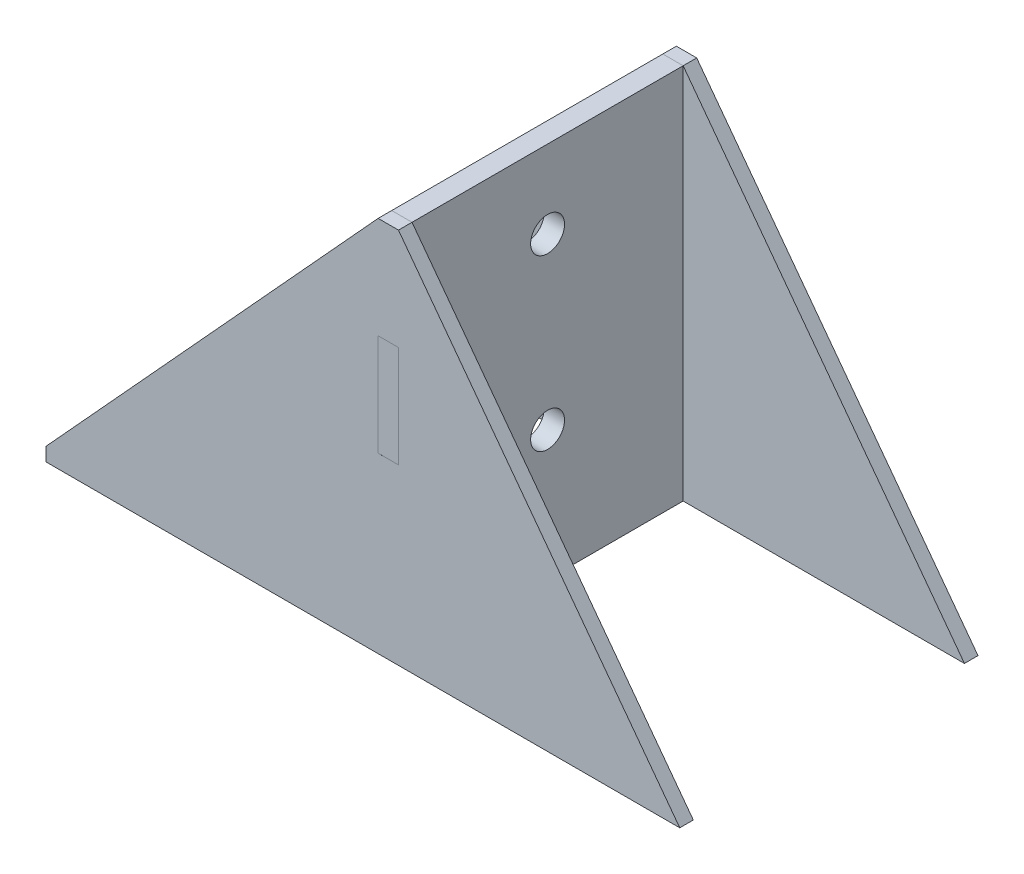
ISO-10303-21;
HEADER;
FILE_DESCRIPTION(('STEP AP214'),'2;1');
FILE_NAME('part.step','',(''),(''),'','','');
FILE_SCHEMA(('AUTOMOTIVE_DESIGN { 1 0 10303 214 1 1 1 1 }'));
ENDSEC;
DATA;
#1=APPLICATION_CONTEXT('core data for automotive mechanical design processes');
#2=APPLICATION_PROTOCOL_DEFINITION('international standard','automotive_design',2000,#1);
#3=PRODUCT_CONTEXT('',#1,'mechanical');
#4=PRODUCT('Part','Part','',(#3));
#5=PRODUCT_RELATED_PRODUCT_CATEGORY('part','',(#4));
#6=PRODUCT_DEFINITION_FORMATION('','',#4);
#7=PRODUCT_DEFINITION_CONTEXT('part definition',#1,'design');
#8=PRODUCT_DEFINITION('design','',#6,#7);
#9=PRODUCT_DEFINITION_SHAPE('','',#8);
#10=(LENGTH_UNIT() NAMED_UNIT(*) SI_UNIT(.MILLI.,.METRE.));
#11=(NAMED_UNIT(*) PLANE_ANGLE_UNIT() SI_UNIT($,.RADIAN.));
#12=(NAMED_UNIT(*) SI_UNIT($,.STERADIAN.) SOLID_ANGLE_UNIT());
#13=UNCERTAINTY_MEASURE_WITH_UNIT(LENGTH_MEASURE(1.E-05),#10,'distance_accuracy_value','');
#14=(GEOMETRIC_REPRESENTATION_CONTEXT(3) GLOBAL_UNCERTAINTY_ASSIGNED_CONTEXT((#13)) GLOBAL_UNIT_ASSIGNED_CONTEXT((#10,
#11,#12)) REPRESENTATION_CONTEXT('',''));
#15=CARTESIAN_POINT('',(0.,0.,0.));
#16=DIRECTION('',(0.,0.,1.));
#17=DIRECTION('',(1.,0.,0.));
#18=AXIS2_PLACEMENT_3D('',#15,#16,#17);
#19=CARTESIAN_POINT('',(-65.8153912675226,0.,157.10520039133));
#20=DIRECTION('',(0.,0.,-1.));
#21=DIRECTION('',(-1.,0.,0.));
#22=AXIS2_PLACEMENT_3D('',#19,#20,#21);
#23=PLANE('',#22);
#24=DIRECTION('',(-0.5980153399495,0.801484655614245,0.));
#25=VECTOR('',#24,1.);
#26=CARTESIAN_POINT('',(285.648958862232,112.506287625418,157.10520039133));
#27=LINE('',#26,#25);
#28=CARTESIAN_POINT('',(368.648958862232,1.26628762541804,157.10520039133));
#29=VERTEX_POINT('',#28);
#30=CARTESIAN_POINT('',(285.648958862232,112.506287625418,157.10520039133));
#31=VERTEX_POINT('',#30);
#32=EDGE_CURVE('E150',#29,#31,#27,.T.);
#33=ORIENTED_EDGE('',*,*,#32,.T.);
#34=DIRECTION('',(-1.,0.,0.));
#35=VECTOR('',#34,1.);
#36=CARTESIAN_POINT('',(285.648958862232,112.506287625418,157.10520039133));
#37=LINE('',#36,#35);
#38=CARTESIAN_POINT('',(279.648958862232,112.506287625418,157.10520039133));
#39=VERTEX_POINT('',#38);
#40=EDGE_CURVE('E153',#31,#39,#37,.T.);
#41=ORIENTED_EDGE('',*,*,#40,.T.);
#42=DIRECTION('',(-0.674589209040015,-0.738193334463788,0.));
#43=VECTOR('',#42,1.);
#44=CARTESIAN_POINT('',(279.648958862232,112.506287625418,157.10520039133));
#45=LINE('',#44,#43);
#46=CARTESIAN_POINT('',(181.648958862232,5.26628762541804,157.10520039133));
#47=VERTEX_POINT('',#46);
#48=EDGE_CURVE('E156',#39,#47,#45,.T.);
#49=ORIENTED_EDGE('',*,*,#48,.T.);
#50=DIRECTION('',(0.,-1.,0.));
#51=VECTOR('',#50,1.);
#52=CARTESIAN_POINT('',(181.648958862232,5.26628762541804,157.10520039133));
#53=LINE('',#52,#51);
#54=CARTESIAN_POINT('',(181.648958862232,1.26628762541804,157.10520039133));
#55=VERTEX_POINT('',#54);
#56=EDGE_CURVE('E158',#47,#55,#53,.T.);
#57=ORIENTED_EDGE('',*,*,#56,.T.);
#58=DIRECTION('',(1.,0.,0.));
#59=VECTOR('',#58,1.);
#60=CARTESIAN_POINT('',(181.648958862232,1.26628762541804,157.10520039133));
#61=LINE('',#60,#59);
#62=EDGE_CURVE('E160',#55,#29,#61,.T.);
#63=ORIENTED_EDGE('',*,*,#62,.T.);
#64=EDGE_LOOP('',(#33,#41,#49,#57,#63));
#65=FACE_BOUND('',#64,.T.);
#66=DIRECTION('',(1.,0.,0.));
#67=VECTOR('',#66,1.);
#68=CARTESIAN_POINT('',(285.648958862232,52.506287625418,157.10520039133));
#69=LINE('',#68,#67);
#70=CARTESIAN_POINT('',(279.648958862232,52.506287625418,157.10520039133));
#71=VERTEX_POINT('',#70);
#72=CARTESIAN_POINT('',(285.648958862232,52.506287625418,157.10520039133));
#73=VERTEX_POINT('',#72);
#74=EDGE_CURVE('E114',#71,#73,#69,.T.);
#75=ORIENTED_EDGE('',*,*,#74,.F.);
#76=DIRECTION('',(0.,-1.,0.));
#77=VECTOR('',#76,1.);
#78=CARTESIAN_POINT('',(279.648958862232,82.5062876254181,157.10520039133));
#79=LINE('',#78,#77);
#80=CARTESIAN_POINT('',(279.648958862232,82.5062876254181,157.10520039133));
#81=VERTEX_POINT('',#80);
#82=EDGE_CURVE('E136',#81,#71,#79,.T.);
#83=ORIENTED_EDGE('',*,*,#82,.F.);
#84=DIRECTION('',(-1.,0.,0.));
#85=VECTOR('',#84,1.);
#86=CARTESIAN_POINT('',(285.648958862232,82.5062876254181,157.10520039133));
#87=LINE('',#86,#85);
#88=CARTESIAN_POINT('',(285.648958862232,82.5062876254181,157.10520039133));
#89=VERTEX_POINT('',#88);
#90=EDGE_CURVE('E134',#89,#81,#87,.T.);
#91=ORIENTED_EDGE('',*,*,#90,.F.);
#92=DIRECTION('',(0.,1.,0.));
#93=VECTOR('',#92,1.);
#94=CARTESIAN_POINT('',(285.648958862232,52.506287625418,157.10520039133));
#95=LINE('',#94,#93);
#96=EDGE_CURVE('E122',#73,#89,#95,.T.);
#97=ORIENTED_EDGE('',*,*,#96,.F.);
#98=EDGE_LOOP('',(#75,#83,#91,#97));
#99=FACE_BOUND('',#98,.T.);
#100=ADVANCED_FACE('F43',(#65,#99),#23,.F.);
#101=CARTESIAN_POINT('',(-65.8153912675226,0.,153.10520039133));
#102=DIRECTION('',(0.,0.,-1.));
#103=DIRECTION('',(-1.,0.,0.));
#104=AXIS2_PLACEMENT_3D('',#101,#102,#103);
#105=PLANE('',#104);
#106=DIRECTION('',(-0.5980153399495,0.801484655614245,0.));
#107=VECTOR('',#106,1.);
#108=CARTESIAN_POINT('',(285.648958862232,112.506287625418,153.10520039133));
#109=LINE('',#108,#107);
#110=CARTESIAN_POINT('',(368.648958862232,1.26628762541804,153.10520039133));
#111=VERTEX_POINT('',#110);
#112=CARTESIAN_POINT('',(285.648958862232,112.506287625418,153.10520039133));
#113=VERTEX_POINT('',#112);
#114=EDGE_CURVE('E130',#111,#113,#109,.T.);
#115=ORIENTED_EDGE('',*,*,#114,.F.);
#116=DIRECTION('',(1.,0.,0.));
#117=VECTOR('',#116,1.);
#118=CARTESIAN_POINT('',(181.648958862232,1.26628762541804,153.10520039133));
#119=LINE('',#118,#117);
#120=CARTESIAN_POINT('',(181.648958862232,1.26628762541804,153.10520039133));
#121=VERTEX_POINT('',#120);
#122=EDGE_CURVE('E154',#121,#111,#119,.T.);
#123=ORIENTED_EDGE('',*,*,#122,.F.);
#124=DIRECTION('',(0.,-1.,0.));
#125=VECTOR('',#124,1.);
#126=CARTESIAN_POINT('',(181.648958862232,5.26628762541804,153.10520039133));
#127=LINE('',#126,#125);
#128=CARTESIAN_POINT('',(181.648958862232,5.26628762541804,153.10520039133));
#129=VERTEX_POINT('',#128);
#130=EDGE_CURVE('E169',#129,#121,#127,.T.);
#131=ORIENTED_EDGE('',*,*,#130,.F.);
#132=DIRECTION('',(-0.674589209040015,-0.738193334463788,0.));
#133=VECTOR('',#132,1.);
#134=CARTESIAN_POINT('',(279.648958862232,112.506287625418,153.10520039133));
#135=LINE('',#134,#133);
#136=CARTESIAN_POINT('',(279.648958862232,112.506287625418,153.10520039133));
#137=VERTEX_POINT('',#136);
#138=EDGE_CURVE('E167',#137,#129,#135,.T.);
#139=ORIENTED_EDGE('',*,*,#138,.F.);
#140=DIRECTION('',(-1.,0.,0.));
#141=VECTOR('',#140,1.);
#142=CARTESIAN_POINT('',(285.648958862232,112.506287625418,153.10520039133));
#143=LINE('',#142,#141);
#144=EDGE_CURVE('E165',#113,#137,#143,.T.);
#145=ORIENTED_EDGE('',*,*,#144,.F.);
#146=EDGE_LOOP('',(#115,#123,#131,#139,#145));
#147=FACE_BOUND('',#146,.T.);
#148=DIRECTION('',(0.,-1.,0.));
#149=VECTOR('',#148,1.);
#150=CARTESIAN_POINT('',(279.648958862232,82.5062876254181,153.10520039133));
#151=LINE('',#150,#149);
#152=CARTESIAN_POINT('',(279.648958862232,82.5062876254181,153.10520039133));
#153=VERTEX_POINT('',#152);
#154=CARTESIAN_POINT('',(279.648958862232,52.506287625418,153.10520039133));
#155=VERTEX_POINT('',#154);
#156=EDGE_CURVE('E123',#153,#155,#151,.T.);
#157=ORIENTED_EDGE('',*,*,#156,.T.);
#158=DIRECTION('',(1.,0.,0.));
#159=VECTOR('',#158,1.);
#160=CARTESIAN_POINT('',(285.648958862232,52.506287625418,153.10520039133));
#161=LINE('',#160,#159);
#162=CARTESIAN_POINT('',(285.648958862232,52.506287625418,153.10520039133));
#163=VERTEX_POINT('',#162);
#164=EDGE_CURVE('E66',#155,#163,#161,.T.);
#165=ORIENTED_EDGE('',*,*,#164,.T.);
#166=DIRECTION('',(0.,1.,0.));
#167=VECTOR('',#166,1.);
#168=CARTESIAN_POINT('',(285.648958862232,52.506287625418,153.10520039133));
#169=LINE('',#168,#167);
#170=CARTESIAN_POINT('',(285.648958862232,82.5062876254181,153.10520039133));
#171=VERTEX_POINT('',#170);
#172=EDGE_CURVE('E129',#163,#171,#169,.T.);
#173=ORIENTED_EDGE('',*,*,#172,.T.);
#174=DIRECTION('',(-1.,0.,0.));
#175=VECTOR('',#174,1.);
#176=CARTESIAN_POINT('',(285.648958862232,82.5062876254181,153.10520039133));
#177=LINE('',#176,#175);
#178=EDGE_CURVE('E142',#171,#153,#177,.T.);
#179=ORIENTED_EDGE('',*,*,#178,.T.);
#180=EDGE_LOOP('',(#157,#165,#173,#179));
#181=FACE_BOUND('',#180,.T.);
#182=ADVANCED_FACE('F190',(#147,#181),#105,.T.);
#183=CARTESIAN_POINT('',(285.648958862232,112.506287625418,157.10520039133));
#184=DIRECTION('',(-0.801484655614245,-0.5980153399495,0.));
#185=DIRECTION('',(0.5980153399495,-0.801484655614245,0.));
#186=AXIS2_PLACEMENT_3D('',#183,#184,#185);
#187=PLANE('',#186);
#188=ORIENTED_EDGE('',*,*,#114,.T.);
#189=DIRECTION('',(0.,0.,-1.));
#190=VECTOR('',#189,1.);
#191=CARTESIAN_POINT('',(285.648958862232,112.506287625418,157.10520039133));
#192=LINE('',#191,#190);
#193=EDGE_CURVE('E12',#31,#113,#192,.T.);
#194=ORIENTED_EDGE('',*,*,#193,.F.);
#195=ORIENTED_EDGE('',*,*,#32,.F.);
#196=DIRECTION('',(0.,0.,-1.));
#197=VECTOR('',#196,1.);
#198=CARTESIAN_POINT('',(368.648958862232,1.26628762541804,157.10520039133));
#199=LINE('',#198,#197);
#200=EDGE_CURVE('E162',#29,#111,#199,.T.);
#201=ORIENTED_EDGE('',*,*,#200,.T.);
#202=EDGE_LOOP('',(#188,#194,#195,#201));
#203=FACE_BOUND('',#202,.T.);
#204=ADVANCED_FACE('F45',(#203),#187,.F.);
#205=CARTESIAN_POINT('',(285.648958862232,112.506287625418,157.10520039133));
#206=DIRECTION('',(0.,-1.,0.));
#207=DIRECTION('',(0.,0.,-1.));
#208=AXIS2_PLACEMENT_3D('',#205,#206,#207);
#209=PLANE('',#208);
#210=ORIENTED_EDGE('',*,*,#144,.T.);
#211=DIRECTION('',(0.,0.,-1.));
#212=VECTOR('',#211,1.);
#213=CARTESIAN_POINT('',(279.648958862232,112.506287625418,157.10520039133));
#214=LINE('',#213,#212);
#215=EDGE_CURVE('E51',#39,#137,#214,.T.);
#216=ORIENTED_EDGE('',*,*,#215,.F.);
#217=ORIENTED_EDGE('',*,*,#40,.F.);
#218=ORIENTED_EDGE('',*,*,#193,.T.);
#219=EDGE_LOOP('',(#210,#216,#217,#218));
#220=FACE_BOUND('',#219,.T.);
#221=ADVANCED_FACE('F204',(#220),#209,.F.);
#222=CARTESIAN_POINT('',(279.648958862232,112.506287625418,157.10520039133));
#223=DIRECTION('',(0.738193334463788,-0.674589209040015,0.));
#224=DIRECTION('',(0.674589209040015,0.738193334463788,0.));
#225=AXIS2_PLACEMENT_3D('',#222,#223,#224);
#226=PLANE('',#225);
#227=ORIENTED_EDGE('',*,*,#138,.T.);
#228=DIRECTION('',(0.,0.,-1.));
#229=VECTOR('',#228,1.);
#230=CARTESIAN_POINT('',(181.648958862232,5.26628762541804,157.10520039133));
#231=LINE('',#230,#229);
#232=EDGE_CURVE('E177',#47,#129,#231,.T.);
#233=ORIENTED_EDGE('',*,*,#232,.F.);
#234=ORIENTED_EDGE('',*,*,#48,.F.);
#235=ORIENTED_EDGE('',*,*,#215,.T.);
#236=EDGE_LOOP('',(#227,#233,#234,#235));
#237=FACE_BOUND('',#236,.T.);
#238=ADVANCED_FACE('F184',(#237),#226,.F.);
#239=CARTESIAN_POINT('',(181.648958862232,5.26628762541804,157.10520039133));
#240=DIRECTION('',(1.,0.,0.));
#241=DIRECTION('',(0.,1.,0.));
#242=AXIS2_PLACEMENT_3D('',#239,#240,#241);
#243=PLANE('',#242);
#244=ORIENTED_EDGE('',*,*,#130,.T.);
#245=DIRECTION('',(0.,0.,-1.));
#246=VECTOR('',#245,1.);
#247=CARTESIAN_POINT('',(181.648958862232,1.26628762541804,157.10520039133));
#248=LINE('',#247,#246);
#249=EDGE_CURVE('E174',#55,#121,#248,.T.);
#250=ORIENTED_EDGE('',*,*,#249,.F.);
#251=ORIENTED_EDGE('',*,*,#56,.F.);
#252=ORIENTED_EDGE('',*,*,#232,.T.);
#253=EDGE_LOOP('',(#244,#250,#251,#252));
#254=FACE_BOUND('',#253,.T.);
#255=ADVANCED_FACE('F195',(#254),#243,.F.);
#256=CARTESIAN_POINT('',(181.648958862232,1.26628762541804,157.10520039133));
#257=DIRECTION('',(0.,1.,0.));
#258=DIRECTION('',(-1.,0.,0.));
#259=AXIS2_PLACEMENT_3D('',#256,#257,#258);
#260=PLANE('',#259);
#261=ORIENTED_EDGE('',*,*,#122,.T.);
#262=ORIENTED_EDGE('',*,*,#200,.F.);
#263=ORIENTED_EDGE('',*,*,#62,.F.);
#264=ORIENTED_EDGE('',*,*,#249,.T.);
#265=EDGE_LOOP('',(#261,#262,#263,#264));
#266=FACE_BOUND('',#265,.T.);
#267=ADVANCED_FACE('F199',(#266),#260,.F.);
#268=CARTESIAN_POINT('',(285.648958862232,52.506287625418,157.10520039133));
#269=DIRECTION('',(0.,1.,0.));
#270=DIRECTION('',(0.,0.,1.));
#271=AXIS2_PLACEMENT_3D('',#268,#269,#270);
#272=PLANE('',#271);
#273=ORIENTED_EDGE('',*,*,#164,.F.);
#274=DIRECTION('',(0.,0.,-1.));
#275=VECTOR('',#274,1.);
#276=CARTESIAN_POINT('',(279.648958862232,52.506287625418,157.10520039133));
#277=LINE('',#276,#275);
#278=EDGE_CURVE('E118',#71,#155,#277,.T.);
#279=ORIENTED_EDGE('',*,*,#278,.F.);
#280=ORIENTED_EDGE('',*,*,#74,.T.);
#281=DIRECTION('',(0.,0.,-1.));
#282=VECTOR('',#281,1.);
#283=CARTESIAN_POINT('',(285.648958862232,52.506287625418,157.10520039133));
#284=LINE('',#283,#282);
#285=EDGE_CURVE('E117',#73,#163,#284,.T.);
#286=ORIENTED_EDGE('',*,*,#285,.T.);
#287=EDGE_LOOP('',(#273,#279,#280,#286));
#288=FACE_BOUND('',#287,.T.);
#289=ADVANCED_FACE('F116',(#288),#272,.T.);
#290=CARTESIAN_POINT('',(285.648958862232,52.506287625418,157.10520039133));
#291=DIRECTION('',(-1.,0.,0.));
#292=DIRECTION('',(0.,0.,1.));
#293=AXIS2_PLACEMENT_3D('',#290,#291,#292);
#294=PLANE('',#293);
#295=ORIENTED_EDGE('',*,*,#172,.F.);
#296=ORIENTED_EDGE('',*,*,#285,.F.);
#297=ORIENTED_EDGE('',*,*,#96,.T.);
#298=DIRECTION('',(0.,0.,-1.));
#299=VECTOR('',#298,1.);
#300=CARTESIAN_POINT('',(285.648958862232,82.5062876254181,157.10520039133));
#301=LINE('',#300,#299);
#302=EDGE_CURVE('E131',#89,#171,#301,.T.);
#303=ORIENTED_EDGE('',*,*,#302,.T.);
#304=EDGE_LOOP('',(#295,#296,#297,#303));
#305=FACE_BOUND('',#304,.T.);
#306=ADVANCED_FACE('F126',(#305),#294,.T.);
#307=CARTESIAN_POINT('',(285.648958862232,82.5062876254181,157.10520039133));
#308=DIRECTION('',(0.,-1.,0.));
#309=DIRECTION('',(0.,0.,-1.));
#310=AXIS2_PLACEMENT_3D('',#307,#308,#309);
#311=PLANE('',#310);
#312=ORIENTED_EDGE('',*,*,#178,.F.);
#313=ORIENTED_EDGE('',*,*,#302,.F.);
#314=ORIENTED_EDGE('',*,*,#90,.T.);
#315=DIRECTION('',(0.,0.,-1.));
#316=VECTOR('',#315,1.);
#317=CARTESIAN_POINT('',(279.648958862232,82.5062876254181,157.10520039133));
#318=LINE('',#317,#316);
#319=EDGE_CURVE('E58',#81,#153,#318,.T.);
#320=ORIENTED_EDGE('',*,*,#319,.T.);
#321=EDGE_LOOP('',(#312,#313,#314,#320));
#322=FACE_BOUND('',#321,.T.);
#323=ADVANCED_FACE('F247',(#322),#311,.T.);
#324=CARTESIAN_POINT('',(279.648958862232,82.5062876254181,157.10520039133));
#325=DIRECTION('',(1.,0.,0.));
#326=DIRECTION('',(0.,0.,-1.));
#327=AXIS2_PLACEMENT_3D('',#324,#325,#326);
#328=PLANE('',#327);
#329=ORIENTED_EDGE('',*,*,#156,.F.);
#330=ORIENTED_EDGE('',*,*,#319,.F.);
#331=ORIENTED_EDGE('',*,*,#82,.T.);
#332=ORIENTED_EDGE('',*,*,#278,.T.);
#333=EDGE_LOOP('',(#329,#330,#331,#332));
#334=FACE_BOUND('',#333,.T.);
#335=ADVANCED_FACE('F253',(#334),#328,.T.);
#336=CLOSED_SHELL('',(#100,#182,#204,#221,#238,#255,#267,#289,#306,#323,#335));
#337=MANIFOLD_SOLID_BREP('B2',#336);
#338=CARTESIAN_POINT('',(285.648958862232,0.,0.));
#339=DIRECTION('',(-1.,0.,0.));
#340=DIRECTION('',(0.,0.,1.));
#341=AXIS2_PLACEMENT_3D('',#338,#339,#340);
#342=PLANE('',#341);
#343=DIRECTION('',(0.,1.,0.));
#344=VECTOR('',#343,1.);
#345=CARTESIAN_POINT('',(285.648958862232,112.507280870062,73.1052003913295));
#346=LINE('',#345,#344);
#347=CARTESIAN_POINT('',(285.648958862232,82.5072808700621,73.1052003913295));
#348=VERTEX_POINT('',#347);
#349=CARTESIAN_POINT('',(285.648958862232,112.507280870062,73.1052003913295));
#350=VERTEX_POINT('',#349);
#351=EDGE_CURVE('E451',#348,#350,#346,.T.);
#352=ORIENTED_EDGE('',*,*,#351,.T.);
#353=DIRECTION('',(0.,0.,1.));
#354=VECTOR('',#353,1.);
#355=CARTESIAN_POINT('',(285.648958862232,112.507280870062,73.1052003913295));
#356=LINE('',#355,#354);
#357=CARTESIAN_POINT('',(285.648958862232,112.507280870062,153.10520039133));
#358=VERTEX_POINT('',#357);
#359=EDGE_CURVE('E379',#350,#358,#356,.T.);
#360=ORIENTED_EDGE('',*,*,#359,.T.);
#361=DIRECTION('',(0.,-1.,0.));
#362=VECTOR('',#361,1.);
#363=CARTESIAN_POINT('',(285.648958862232,112.507280870062,153.10520039133));
#364=LINE('',#363,#362);
#365=CARTESIAN_POINT('',(285.648958862232,82.5072808700621,153.10520039133));
#366=VERTEX_POINT('',#365);
#367=EDGE_CURVE('E478',#358,#366,#364,.T.);
#368=ORIENTED_EDGE('',*,*,#367,.T.);
#369=DIRECTION('',(0.,0.,1.));
#370=VECTOR('',#369,1.);
#371=CARTESIAN_POINT('',(285.648958862232,82.5072808700621,157.10520039133));
#372=LINE('',#371,#370);
#373=CARTESIAN_POINT('',(285.648958862232,82.5072808700621,157.10520039133));
#374=VERTEX_POINT('',#373);
#375=EDGE_CURVE('E497',#366,#374,#372,.T.);
#376=ORIENTED_EDGE('',*,*,#375,.T.);
#377=DIRECTION('',(0.,-1.,0.));
#378=VECTOR('',#377,1.);
#379=CARTESIAN_POINT('',(285.648958862232,52.5072808700621,157.10520039133));
#380=LINE('',#379,#378);
#381=CARTESIAN_POINT('',(285.648958862232,52.5072808700621,157.10520039133));
#382=VERTEX_POINT('',#381);
#383=EDGE_CURVE('E494',#374,#382,#380,.T.);
#384=ORIENTED_EDGE('',*,*,#383,.T.);
#385=DIRECTION('',(0.,0.,-1.));
#386=VECTOR('',#385,1.);
#387=CARTESIAN_POINT('',(285.648958862232,52.5072808700621,157.10520039133));
#388=LINE('',#387,#386);
#389=CARTESIAN_POINT('',(285.648958862232,52.5072808700621,153.10520039133));
#390=VERTEX_POINT('',#389);
#391=EDGE_CURVE('E496',#382,#390,#388,.T.);
#392=ORIENTED_EDGE('',*,*,#391,.T.);
#393=DIRECTION('',(0.,-1.,0.));
#394=VECTOR('',#393,1.);
#395=CARTESIAN_POINT('',(285.648958862232,52.5072808700621,153.10520039133));
#396=LINE('',#395,#394);
#397=CARTESIAN_POINT('',(285.648958862232,1.26728087006206,153.10520039133));
#398=VERTEX_POINT('',#397);
#399=EDGE_CURVE('E499',#390,#398,#396,.T.);
#400=ORIENTED_EDGE('',*,*,#399,.T.);
#401=DIRECTION('',(0.,0.,-1.));
#402=VECTOR('',#401,1.);
#403=CARTESIAN_POINT('',(285.648958862232,1.26728087006206,153.10520039133));
#404=LINE('',#403,#402);
#405=CARTESIAN_POINT('',(285.648958862232,1.26728087006206,73.1052003913295));
#406=VERTEX_POINT('',#405);
#407=EDGE_CURVE('E505',#398,#406,#404,.T.);
#408=ORIENTED_EDGE('',*,*,#407,.T.);
#409=DIRECTION('',(0.,1.,0.));
#410=VECTOR('',#409,1.);
#411=CARTESIAN_POINT('',(285.648958862232,52.5072808700621,73.1052003913295));
#412=LINE('',#411,#410);
#413=CARTESIAN_POINT('',(285.648958862232,52.5072808700621,73.1052003913295));
#414=VERTEX_POINT('',#413);
#415=EDGE_CURVE('E410',#406,#414,#412,.T.);
#416=ORIENTED_EDGE('',*,*,#415,.T.);
#417=DIRECTION('',(0.,0.,-1.));
#418=VECTOR('',#417,1.);
#419=CARTESIAN_POINT('',(285.648958862232,52.5072808700621,69.1052003913295));
#420=LINE('',#419,#418);
#421=CARTESIAN_POINT('',(285.648958862232,52.5072808700621,69.1052003913295));
#422=VERTEX_POINT('',#421);
#423=EDGE_CURVE('E404',#414,#422,#420,.T.);
#424=ORIENTED_EDGE('',*,*,#423,.T.);
#425=DIRECTION('',(0.,1.,0.));
#426=VECTOR('',#425,1.);
#427=CARTESIAN_POINT('',(285.648958862232,82.5072808700621,69.1052003913295));
#428=LINE('',#427,#426);
#429=CARTESIAN_POINT('',(285.648958862232,82.5072808700621,69.1052003913295));
#430=VERTEX_POINT('',#429);
#431=EDGE_CURVE('E408',#422,#430,#428,.T.);
#432=ORIENTED_EDGE('',*,*,#431,.T.);
#433=DIRECTION('',(0.,0.,1.));
#434=VECTOR('',#433,1.);
#435=CARTESIAN_POINT('',(285.648958862232,82.5072808700621,69.1052003913295));
#436=LINE('',#435,#434);
#437=EDGE_CURVE('E324',#430,#348,#436,.T.);
#438=ORIENTED_EDGE('',*,*,#437,.T.);
#439=EDGE_LOOP('',(#352,#360,#368,#376,#384,#392,#400,#408,#416,#424,#432,#438));
#440=FACE_BOUND('',#439,.T.);
#441=CARTESIAN_POINT('',(285.648958862232,89.5072808700621,113.105200391329));
#442=DIRECTION('',(1.,0.,0.));
#443=DIRECTION('',(0.,0.,-1.));
#444=AXIS2_PLACEMENT_3D('',#441,#442,#443);
#445=CIRCLE('',#444,5.00392187613646);
#446=CARTESIAN_POINT('',(285.648958862232,89.5072808700621,108.101278515193));
#447=VERTEX_POINT('',#446);
#448=EDGE_CURVE('E432',#447,#447,#445,.T.);
#449=ORIENTED_EDGE('',*,*,#448,.F.);
#450=EDGE_LOOP('',(#449));
#451=FACE_BOUND('',#450,.T.);
#452=CARTESIAN_POINT('',(285.648958862232,39.4680621086975,113.105200391329));
#453=DIRECTION('',(1.,0.,0.));
#454=DIRECTION('',(0.,0.,-1.));
#455=AXIS2_PLACEMENT_3D('',#452,#453,#454);
#456=CIRCLE('',#455,5.00392187613646);
#457=CARTESIAN_POINT('',(285.648958862232,39.4680621086975,108.101278515193));
#458=VERTEX_POINT('',#457);
#459=EDGE_CURVE('E546',#458,#458,#456,.T.);
#460=ORIENTED_EDGE('',*,*,#459,.F.);
#461=EDGE_LOOP('',(#460));
#462=FACE_BOUND('',#461,.T.);
#463=ADVANCED_FACE('F307',(#440,#451,#462),#342,.F.);
#464=CARTESIAN_POINT('',(279.648958862232,0.,0.));
#465=DIRECTION('',(-1.,0.,0.));
#466=DIRECTION('',(0.,0.,1.));
#467=AXIS2_PLACEMENT_3D('',#464,#465,#466);
#468=PLANE('',#467);
#469=CARTESIAN_POINT('',(279.648958862232,89.5072808700621,113.105200391329));
#470=DIRECTION('',(1.,0.,0.));
#471=DIRECTION('',(0.,0.,-1.));
#472=AXIS2_PLACEMENT_3D('',#469,#470,#471);
#473=CIRCLE('',#472,5.00392187613646);
#474=CARTESIAN_POINT('',(279.648958862232,89.5072808700621,108.101278515193));
#475=VERTEX_POINT('',#474);
#476=EDGE_CURVE('E551',#475,#475,#473,.T.);
#477=ORIENTED_EDGE('',*,*,#476,.T.);
#478=EDGE_LOOP('',(#477));
#479=FACE_BOUND('',#478,.T.);
#480=DIRECTION('',(0.,1.,0.));
#481=VECTOR('',#480,1.);
#482=CARTESIAN_POINT('',(279.648958862232,112.507280870062,73.1052003913295));
#483=LINE('',#482,#481);
#484=CARTESIAN_POINT('',(279.648958862232,82.5072808700621,73.1052003913295));
#485=VERTEX_POINT('',#484);
#486=CARTESIAN_POINT('',(279.648958862232,112.507280870062,73.1052003913295));
#487=VERTEX_POINT('',#486);
#488=EDGE_CURVE('E428',#485,#487,#483,.T.);
#489=ORIENTED_EDGE('',*,*,#488,.F.);
#490=DIRECTION('',(0.,0.,1.));
#491=VECTOR('',#490,1.);
#492=CARTESIAN_POINT('',(279.648958862232,82.5072808700621,69.1052003913295));
#493=LINE('',#492,#491);
#494=CARTESIAN_POINT('',(279.648958862232,82.5072808700621,69.1052003913295));
#495=VERTEX_POINT('',#494);
#496=EDGE_CURVE('E371',#495,#485,#493,.T.);
#497=ORIENTED_EDGE('',*,*,#496,.F.);
#498=DIRECTION('',(0.,1.,0.));
#499=VECTOR('',#498,1.);
#500=CARTESIAN_POINT('',(279.648958862232,82.5072808700621,69.1052003913295));
#501=LINE('',#500,#499);
#502=CARTESIAN_POINT('',(279.648958862232,52.5072808700621,69.1052003913295));
#503=VERTEX_POINT('',#502);
#504=EDGE_CURVE('E365',#503,#495,#501,.T.);
#505=ORIENTED_EDGE('',*,*,#504,.F.);
#506=DIRECTION('',(0.,0.,-1.));
#507=VECTOR('',#506,1.);
#508=CARTESIAN_POINT('',(279.648958862232,52.5072808700621,69.1052003913295));
#509=LINE('',#508,#507);
#510=CARTESIAN_POINT('',(279.648958862232,52.5072808700621,73.1052003913295));
#511=VERTEX_POINT('',#510);
#512=EDGE_CURVE('E418',#511,#503,#509,.T.);
#513=ORIENTED_EDGE('',*,*,#512,.F.);
#514=DIRECTION('',(0.,1.,0.));
#515=VECTOR('',#514,1.);
#516=CARTESIAN_POINT('',(279.648958862232,52.5072808700621,73.1052003913295));
#517=LINE('',#516,#515);
#518=CARTESIAN_POINT('',(279.648958862232,1.26728087006206,73.1052003913295));
#519=VERTEX_POINT('',#518);
#520=EDGE_CURVE('E446',#519,#511,#517,.T.);
#521=ORIENTED_EDGE('',*,*,#520,.F.);
#522=DIRECTION('',(0.,0.,-1.));
#523=VECTOR('',#522,1.);
#524=CARTESIAN_POINT('',(279.648958862232,1.26728087006206,153.10520039133));
#525=LINE('',#524,#523);
#526=CARTESIAN_POINT('',(279.648958862232,1.26728087006206,153.10520039133));
#527=VERTEX_POINT('',#526);
#528=EDGE_CURVE('E444',#527,#519,#525,.T.);
#529=ORIENTED_EDGE('',*,*,#528,.F.);
#530=DIRECTION('',(0.,-1.,0.));
#531=VECTOR('',#530,1.);
#532=CARTESIAN_POINT('',(279.648958862232,52.5072808700621,153.10520039133));
#533=LINE('',#532,#531);
#534=CARTESIAN_POINT('',(279.648958862232,52.5072808700621,153.10520039133));
#535=VERTEX_POINT('',#534);
#536=EDGE_CURVE('E442',#535,#527,#533,.T.);
#537=ORIENTED_EDGE('',*,*,#536,.F.);
#538=DIRECTION('',(0.,0.,-1.));
#539=VECTOR('',#538,1.);
#540=CARTESIAN_POINT('',(279.648958862232,52.5072808700621,157.10520039133));
#541=LINE('',#540,#539);
#542=CARTESIAN_POINT('',(279.648958862232,52.5072808700621,157.10520039133));
#543=VERTEX_POINT('',#542);
#544=EDGE_CURVE('E440',#543,#535,#541,.T.);
#545=ORIENTED_EDGE('',*,*,#544,.F.);
#546=DIRECTION('',(0.,-1.,0.));
#547=VECTOR('',#546,1.);
#548=CARTESIAN_POINT('',(279.648958862232,52.5072808700621,157.10520039133));
#549=LINE('',#548,#547);
#550=CARTESIAN_POINT('',(279.648958862232,82.5072808700621,157.10520039133));
#551=VERTEX_POINT('',#550);
#552=EDGE_CURVE('E438',#551,#543,#549,.T.);
#553=ORIENTED_EDGE('',*,*,#552,.F.);
#554=DIRECTION('',(0.,0.,1.));
#555=VECTOR('',#554,1.);
#556=CARTESIAN_POINT('',(279.648958862232,82.5072808700621,157.10520039133));
#557=LINE('',#556,#555);
#558=CARTESIAN_POINT('',(279.648958862232,82.5072808700621,153.10520039133));
#559=VERTEX_POINT('',#558);
#560=EDGE_CURVE('E436',#559,#551,#557,.T.);
#561=ORIENTED_EDGE('',*,*,#560,.F.);
#562=DIRECTION('',(0.,-1.,0.));
#563=VECTOR('',#562,1.);
#564=CARTESIAN_POINT('',(279.648958862232,112.507280870062,153.10520039133));
#565=LINE('',#564,#563);
#566=CARTESIAN_POINT('',(279.648958862232,112.507280870062,153.10520039133));
#567=VERTEX_POINT('',#566);
#568=EDGE_CURVE('E434',#567,#559,#565,.T.);
#569=ORIENTED_EDGE('',*,*,#568,.F.);
#570=DIRECTION('',(0.,0.,1.));
#571=VECTOR('',#570,1.);
#572=CARTESIAN_POINT('',(279.648958862232,112.507280870062,73.1052003913295));
#573=LINE('',#572,#571);
#574=EDGE_CURVE('E431',#487,#567,#573,.T.);
#575=ORIENTED_EDGE('',*,*,#574,.F.);
#576=EDGE_LOOP('',(#489,#497,#505,#513,#521,#529,#537,#545,#553,#561,#569,#575));
#577=FACE_BOUND('',#576,.T.);
#578=CARTESIAN_POINT('',(279.648958862232,39.4680621086975,113.105200391329));
#579=DIRECTION('',(1.,0.,0.));
#580=DIRECTION('',(0.,0.,-1.));
#581=AXIS2_PLACEMENT_3D('',#578,#579,#580);
#582=CIRCLE('',#581,5.00392187613646);
#583=CARTESIAN_POINT('',(279.648958862232,39.4680621086975,108.101278515193));
#584=VERTEX_POINT('',#583);
#585=EDGE_CURVE('E549',#584,#584,#582,.T.);
#586=ORIENTED_EDGE('',*,*,#585,.T.);
#587=EDGE_LOOP('',(#586));
#588=FACE_BOUND('',#587,.T.);
#589=ADVANCED_FACE('F482',(#479,#577,#588),#468,.T.);
#590=CARTESIAN_POINT('',(285.648958862232,112.507280870062,73.1052003913295));
#591=DIRECTION('',(0.,0.,1.));
#592=DIRECTION('',(1.,0.,0.));
#593=AXIS2_PLACEMENT_3D('',#590,#591,#592);
#594=PLANE('',#593);
#595=ORIENTED_EDGE('',*,*,#488,.T.);
#596=DIRECTION('',(-1.,0.,0.));
#597=VECTOR('',#596,1.);
#598=CARTESIAN_POINT('',(285.648958862232,112.507280870062,73.1052003913295));
#599=LINE('',#598,#597);
#600=EDGE_CURVE('E41',#350,#487,#599,.T.);
#601=ORIENTED_EDGE('',*,*,#600,.F.);
#602=ORIENTED_EDGE('',*,*,#351,.F.);
#603=DIRECTION('',(-1.,0.,0.));
#604=VECTOR('',#603,1.);
#605=CARTESIAN_POINT('',(285.648958862232,82.5072808700621,73.1052003913295));
#606=LINE('',#605,#604);
#607=EDGE_CURVE('E424',#348,#485,#606,.T.);
#608=ORIENTED_EDGE('',*,*,#607,.T.);
#609=EDGE_LOOP('',(#595,#601,#602,#608));
#610=FACE_BOUND('',#609,.T.);
#611=ADVANCED_FACE('F309',(#610),#594,.F.);
#612=CARTESIAN_POINT('',(285.648958862232,112.507280870062,73.1052003913295));
#613=DIRECTION('',(0.,-1.,0.));
#614=DIRECTION('',(0.,0.,-1.));
#615=AXIS2_PLACEMENT_3D('',#612,#613,#614);
#616=PLANE('',#615);
#617=ORIENTED_EDGE('',*,*,#574,.T.);
#618=DIRECTION('',(-1.,0.,0.));
#619=VECTOR('',#618,1.);
#620=CARTESIAN_POINT('',(285.648958862232,112.507280870062,153.10520039133));
#621=LINE('',#620,#619);
#622=EDGE_CURVE('E316',#358,#567,#621,.T.);
#623=ORIENTED_EDGE('',*,*,#622,.F.);
#624=ORIENTED_EDGE('',*,*,#359,.F.);
#625=ORIENTED_EDGE('',*,*,#600,.T.);
#626=EDGE_LOOP('',(#617,#623,#624,#625));
#627=FACE_BOUND('',#626,.T.);
#628=ADVANCED_FACE('F646',(#627),#616,.F.);
#629=CARTESIAN_POINT('',(285.648958862232,112.507280870062,153.10520039133));
#630=DIRECTION('',(0.,0.,-1.));
#631=DIRECTION('',(-1.,0.,0.));
#632=AXIS2_PLACEMENT_3D('',#629,#630,#631);
#633=PLANE('',#632);
#634=ORIENTED_EDGE('',*,*,#568,.T.);
#635=DIRECTION('',(-1.,0.,0.));
#636=VECTOR('',#635,1.);
#637=CARTESIAN_POINT('',(285.648958862232,82.5072808700621,153.10520039133));
#638=LINE('',#637,#636);
#639=EDGE_CURVE('E470',#366,#559,#638,.T.);
#640=ORIENTED_EDGE('',*,*,#639,.F.);
#641=ORIENTED_EDGE('',*,*,#367,.F.);
#642=ORIENTED_EDGE('',*,*,#622,.T.);
#643=EDGE_LOOP('',(#634,#640,#641,#642));
#644=FACE_BOUND('',#643,.T.);
#645=ADVANCED_FACE('F476',(#644),#633,.F.);
#646=CARTESIAN_POINT('',(285.648958862232,82.5072808700621,157.10520039133));
#647=DIRECTION('',(0.,-1.,0.));
#648=DIRECTION('',(0.,0.,-1.));
#649=AXIS2_PLACEMENT_3D('',#646,#647,#648);
#650=PLANE('',#649);
#651=ORIENTED_EDGE('',*,*,#560,.T.);
#652=DIRECTION('',(-1.,0.,0.));
#653=VECTOR('',#652,1.);
#654=CARTESIAN_POINT('',(285.648958862232,82.5072808700621,157.10520039133));
#655=LINE('',#654,#653);
#656=EDGE_CURVE('E467',#374,#551,#655,.T.);
#657=ORIENTED_EDGE('',*,*,#656,.F.);
#658=ORIENTED_EDGE('',*,*,#375,.F.);
#659=ORIENTED_EDGE('',*,*,#639,.T.);
#660=EDGE_LOOP('',(#651,#657,#658,#659));
#661=FACE_BOUND('',#660,.T.);
#662=ADVANCED_FACE('F488',(#661),#650,.F.);
#663=CARTESIAN_POINT('',(285.648958862232,52.5072808700621,157.10520039133));
#664=DIRECTION('',(0.,0.,-1.));
#665=DIRECTION('',(-1.,0.,0.));
#666=AXIS2_PLACEMENT_3D('',#663,#664,#665);
#667=PLANE('',#666);
#668=ORIENTED_EDGE('',*,*,#552,.T.);
#669=DIRECTION('',(-1.,0.,0.));
#670=VECTOR('',#669,1.);
#671=CARTESIAN_POINT('',(285.648958862232,52.5072808700621,157.10520039133));
#672=LINE('',#671,#670);
#673=EDGE_CURVE('E464',#382,#543,#672,.T.);
#674=ORIENTED_EDGE('',*,*,#673,.F.);
#675=ORIENTED_EDGE('',*,*,#383,.F.);
#676=ORIENTED_EDGE('',*,*,#656,.T.);
#677=EDGE_LOOP('',(#668,#674,#675,#676));
#678=FACE_BOUND('',#677,.T.);
#679=ADVANCED_FACE('F492',(#678),#667,.F.);
#680=CARTESIAN_POINT('',(285.648958862232,52.5072808700621,157.10520039133));
#681=DIRECTION('',(0.,1.,0.));
#682=DIRECTION('',(0.,0.,1.));
#683=AXIS2_PLACEMENT_3D('',#680,#681,#682);
#684=PLANE('',#683);
#685=ORIENTED_EDGE('',*,*,#544,.T.);
#686=DIRECTION('',(-1.,0.,0.));
#687=VECTOR('',#686,1.);
#688=CARTESIAN_POINT('',(285.648958862232,52.5072808700621,153.10520039133));
#689=LINE('',#688,#687);
#690=EDGE_CURVE('E461',#390,#535,#689,.T.);
#691=ORIENTED_EDGE('',*,*,#690,.F.);
#692=ORIENTED_EDGE('',*,*,#391,.F.);
#693=ORIENTED_EDGE('',*,*,#673,.T.);
#694=EDGE_LOOP('',(#685,#691,#692,#693));
#695=FACE_BOUND('',#694,.T.);
#696=ADVANCED_FACE('F611',(#695),#684,.F.);
#697=CARTESIAN_POINT('',(285.648958862232,52.5072808700621,153.10520039133));
#698=DIRECTION('',(0.,0.,-1.));
#699=DIRECTION('',(-1.,0.,0.));
#700=AXIS2_PLACEMENT_3D('',#697,#698,#699);
#701=PLANE('',#700);
#702=ORIENTED_EDGE('',*,*,#536,.T.);
#703=DIRECTION('',(-1.,0.,0.));
#704=VECTOR('',#703,1.);
#705=CARTESIAN_POINT('',(285.648958862232,1.26728087006206,153.10520039133));
#706=LINE('',#705,#704);
#707=EDGE_CURVE('E458',#398,#527,#706,.T.);
#708=ORIENTED_EDGE('',*,*,#707,.F.);
#709=ORIENTED_EDGE('',*,*,#399,.F.);
#710=ORIENTED_EDGE('',*,*,#690,.T.);
#711=EDGE_LOOP('',(#702,#708,#709,#710));
#712=FACE_BOUND('',#711,.T.);
#713=ADVANCED_FACE('F602',(#712),#701,.F.);
#714=CARTESIAN_POINT('',(285.648958862232,1.26728087006206,153.10520039133));
#715=DIRECTION('',(0.,1.,0.));
#716=DIRECTION('',(0.,0.,1.));
#717=AXIS2_PLACEMENT_3D('',#714,#715,#716);
#718=PLANE('',#717);
#719=ORIENTED_EDGE('',*,*,#528,.T.);
#720=DIRECTION('',(-1.,0.,0.));
#721=VECTOR('',#720,1.);
#722=CARTESIAN_POINT('',(285.648958862232,1.26728087006206,73.1052003913295));
#723=LINE('',#722,#721);
#724=EDGE_CURVE('E455',#406,#519,#723,.T.);
#725=ORIENTED_EDGE('',*,*,#724,.F.);
#726=ORIENTED_EDGE('',*,*,#407,.F.);
#727=ORIENTED_EDGE('',*,*,#707,.T.);
#728=EDGE_LOOP('',(#719,#725,#726,#727));
#729=FACE_BOUND('',#728,.T.);
#730=ADVANCED_FACE('F511',(#729),#718,.F.);
#731=CARTESIAN_POINT('',(285.648958862232,52.5072808700621,73.1052003913295));
#732=DIRECTION('',(0.,0.,1.));
#733=DIRECTION('',(0.,-1.,0.));
#734=AXIS2_PLACEMENT_3D('',#731,#732,#733);
#735=PLANE('',#734);
#736=ORIENTED_EDGE('',*,*,#520,.T.);
#737=DIRECTION('',(-1.,0.,0.));
#738=VECTOR('',#737,1.);
#739=CARTESIAN_POINT('',(285.648958862232,52.5072808700621,73.1052003913295));
#740=LINE('',#739,#738);
#741=EDGE_CURVE('E419',#414,#511,#740,.T.);
#742=ORIENTED_EDGE('',*,*,#741,.F.);
#743=ORIENTED_EDGE('',*,*,#415,.F.);
#744=ORIENTED_EDGE('',*,*,#724,.T.);
#745=EDGE_LOOP('',(#736,#742,#743,#744));
#746=FACE_BOUND('',#745,.T.);
#747=ADVANCED_FACE('F515',(#746),#735,.F.);
#748=CARTESIAN_POINT('',(285.648958862232,52.5072808700621,69.1052003913295));
#749=DIRECTION('',(0.,1.,0.));
#750=DIRECTION('',(0.,0.,1.));
#751=AXIS2_PLACEMENT_3D('',#748,#749,#750);
#752=PLANE('',#751);
#753=ORIENTED_EDGE('',*,*,#512,.T.);
#754=DIRECTION('',(-1.,0.,0.));
#755=VECTOR('',#754,1.);
#756=CARTESIAN_POINT('',(285.648958862232,52.5072808700621,69.1052003913295));
#757=LINE('',#756,#755);
#758=EDGE_CURVE('E415',#422,#503,#757,.T.);
#759=ORIENTED_EDGE('',*,*,#758,.F.);
#760=ORIENTED_EDGE('',*,*,#423,.F.);
#761=ORIENTED_EDGE('',*,*,#741,.T.);
#762=EDGE_LOOP('',(#753,#759,#760,#761));
#763=FACE_BOUND('',#762,.T.);
#764=ADVANCED_FACE('F416',(#763),#752,.F.);
#765=CARTESIAN_POINT('',(285.648958862232,82.5072808700621,69.1052003913295));
#766=DIRECTION('',(0.,0.,1.));
#767=DIRECTION('',(1.,0.,0.));
#768=AXIS2_PLACEMENT_3D('',#765,#766,#767);
#769=PLANE('',#768);
#770=ORIENTED_EDGE('',*,*,#504,.T.);
#771=DIRECTION('',(-1.,0.,0.));
#772=VECTOR('',#771,1.);
#773=CARTESIAN_POINT('',(285.648958862232,82.5072808700621,69.1052003913295));
#774=LINE('',#773,#772);
#775=EDGE_CURVE('E420',#430,#495,#774,.T.);
#776=ORIENTED_EDGE('',*,*,#775,.F.);
#777=ORIENTED_EDGE('',*,*,#431,.F.);
#778=ORIENTED_EDGE('',*,*,#758,.T.);
#779=EDGE_LOOP('',(#770,#776,#777,#778));
#780=FACE_BOUND('',#779,.T.);
#781=ADVANCED_FACE('F422',(#780),#769,.F.);
#782=CARTESIAN_POINT('',(285.648958862232,82.5072808700621,69.1052003913295));
#783=DIRECTION('',(0.,-1.,0.));
#784=DIRECTION('',(0.,0.,-1.));
#785=AXIS2_PLACEMENT_3D('',#782,#783,#784);
#786=PLANE('',#785);
#787=ORIENTED_EDGE('',*,*,#496,.T.);
#788=ORIENTED_EDGE('',*,*,#607,.F.);
#789=ORIENTED_EDGE('',*,*,#437,.F.);
#790=ORIENTED_EDGE('',*,*,#775,.T.);
#791=EDGE_LOOP('',(#787,#788,#789,#790));
#792=FACE_BOUND('',#791,.T.);
#793=ADVANCED_FACE('F519',(#792),#786,.F.);
#794=CARTESIAN_POINT('',(285.648958862232,89.5072808700621,113.105200391329));
#795=DIRECTION('',(-1.,0.,0.));
#796=DIRECTION('',(0.,0.,1.));
#797=AXIS2_PLACEMENT_3D('',#794,#795,#796);
#798=CYLINDRICAL_SURFACE('',#797,5.00392187613646);
#799=ORIENTED_EDGE('',*,*,#448,.T.);
#800=EDGE_LOOP('',(#799));
#801=FACE_BOUND('',#800,.T.);
#802=ORIENTED_EDGE('',*,*,#476,.F.);
#803=EDGE_LOOP('',(#802));
#804=FACE_BOUND('',#803,.T.);
#805=ADVANCED_FACE('F521',(#801,#804),#798,.F.);
#806=CARTESIAN_POINT('',(285.648958862232,39.4680621086975,113.105200391329));
#807=DIRECTION('',(-1.,0.,0.));
#808=DIRECTION('',(0.,0.,1.));
#809=AXIS2_PLACEMENT_3D('',#806,#807,#808);
#810=CYLINDRICAL_SURFACE('',#809,5.00392187613646);
#811=ORIENTED_EDGE('',*,*,#459,.T.);
#812=EDGE_LOOP('',(#811));
#813=FACE_BOUND('',#812,.T.);
#814=ORIENTED_EDGE('',*,*,#585,.F.);
#815=EDGE_LOOP('',(#814));
#816=FACE_BOUND('',#815,.T.);
#817=ADVANCED_FACE('F527',(#813,#816),#810,.F.);
#818=CLOSED_SHELL('',(#463,#589,#611,#628,#645,#662,#679,#696,#713,#730,#747,#764,#781,#793,
#805,#817));
#819=MANIFOLD_SOLID_BREP('B6',#818);
#820=CARTESIAN_POINT('',(-65.8153912675226,0.,73.1052003913295));
#821=DIRECTION('',(0.,0.,-1.));
#822=DIRECTION('',(-1.,0.,0.));
#823=AXIS2_PLACEMENT_3D('',#820,#821,#822);
#824=PLANE('',#823);
#825=DIRECTION('',(-0.5980153399495,0.801484655614245,0.));
#826=VECTOR('',#825,1.);
#827=CARTESIAN_POINT('',(285.648958862232,112.506287625418,73.1052003913295));
#828=LINE('',#827,#826);
#829=CARTESIAN_POINT('',(368.648958862232,1.26628762541804,73.1052003913295));
#830=VERTEX_POINT('',#829);
#831=CARTESIAN_POINT('',(285.648958862232,112.506287625418,73.1052003913295));
#832=VERTEX_POINT('',#831);
#833=EDGE_CURVE('E787',#830,#832,#828,.T.);
#834=ORIENTED_EDGE('',*,*,#833,.T.);
#835=DIRECTION('',(-1.,0.,0.));
#836=VECTOR('',#835,1.);
#837=CARTESIAN_POINT('',(285.648958862232,112.506287625418,73.1052003913295));
#838=LINE('',#837,#836);
#839=CARTESIAN_POINT('',(279.648958862232,112.506287625418,73.1052003913295));
#840=VERTEX_POINT('',#839);
#841=EDGE_CURVE('E790',#832,#840,#838,.T.);
#842=ORIENTED_EDGE('',*,*,#841,.T.);
#843=DIRECTION('',(-0.674589209040015,-0.738193334463788,0.));
#844=VECTOR('',#843,1.);
#845=CARTESIAN_POINT('',(279.648958862232,112.506287625418,73.1052003913295));
#846=LINE('',#845,#844);
#847=CARTESIAN_POINT('',(181.648958862232,5.26628762541804,73.1052003913295));
#848=VERTEX_POINT('',#847);
#849=EDGE_CURVE('E793',#840,#848,#846,.T.);
#850=ORIENTED_EDGE('',*,*,#849,.T.);
#851=DIRECTION('',(0.,-1.,0.));
#852=VECTOR('',#851,1.);
#853=CARTESIAN_POINT('',(181.648958862232,5.26628762541804,73.1052003913295));
#854=LINE('',#853,#852);
#855=CARTESIAN_POINT('',(181.648958862232,1.26628762541804,73.1052003913295));
#856=VERTEX_POINT('',#855);
#857=EDGE_CURVE('E795',#848,#856,#854,.T.);
#858=ORIENTED_EDGE('',*,*,#857,.T.);
#859=DIRECTION('',(1.,0.,0.));
#860=VECTOR('',#859,1.);
#861=CARTESIAN_POINT('',(181.648958862232,1.26628762541804,73.1052003913295));
#862=LINE('',#861,#860);
#863=EDGE_CURVE('E797',#856,#830,#862,.T.);
#864=ORIENTED_EDGE('',*,*,#863,.T.);
#865=EDGE_LOOP('',(#834,#842,#850,#858,#864));
#866=FACE_BOUND('',#865,.T.);
#867=DIRECTION('',(1.,0.,0.));
#868=VECTOR('',#867,1.);
#869=CARTESIAN_POINT('',(285.648958862232,52.506287625418,73.1052003913295));
#870=LINE('',#869,#868);
#871=CARTESIAN_POINT('',(279.648958862232,52.506287625418,73.1052003913295));
#872=VERTEX_POINT('',#871);
#873=CARTESIAN_POINT('',(285.648958862232,52.506287625418,73.1052003913295));
#874=VERTEX_POINT('',#873);
#875=EDGE_CURVE('E751',#872,#874,#870,.T.);
#876=ORIENTED_EDGE('',*,*,#875,.F.);
#877=DIRECTION('',(0.,-1.,0.));
#878=VECTOR('',#877,1.);
#879=CARTESIAN_POINT('',(279.648958862232,82.5062876254181,73.1052003913295));
#880=LINE('',#879,#878);
#881=CARTESIAN_POINT('',(279.648958862232,82.5062876254181,73.1052003913295));
#882=VERTEX_POINT('',#881);
#883=EDGE_CURVE('E773',#882,#872,#880,.T.);
#884=ORIENTED_EDGE('',*,*,#883,.F.);
#885=DIRECTION('',(-1.,0.,0.));
#886=VECTOR('',#885,1.);
#887=CARTESIAN_POINT('',(285.648958862232,82.5062876254181,73.1052003913295));
#888=LINE('',#887,#886);
#889=CARTESIAN_POINT('',(285.648958862232,82.5062876254181,73.1052003913295));
#890=VERTEX_POINT('',#889);
#891=EDGE_CURVE('E771',#890,#882,#888,.T.);
#892=ORIENTED_EDGE('',*,*,#891,.F.);
#893=DIRECTION('',(0.,1.,0.));
#894=VECTOR('',#893,1.);
#895=CARTESIAN_POINT('',(285.648958862232,52.506287625418,73.1052003913295));
#896=LINE('',#895,#894);
#897=EDGE_CURVE('E759',#874,#890,#896,.T.);
#898=ORIENTED_EDGE('',*,*,#897,.F.);
#899=EDGE_LOOP('',(#876,#884,#892,#898));
#900=FACE_BOUND('',#899,.T.);
#901=ADVANCED_FACE('F680',(#866,#900),#824,.F.);
#902=CARTESIAN_POINT('',(-65.8153912675226,0.,69.1052003913295));
#903=DIRECTION('',(0.,0.,-1.));
#904=DIRECTION('',(-1.,0.,0.));
#905=AXIS2_PLACEMENT_3D('',#902,#903,#904);
#906=PLANE('',#905);
#907=DIRECTION('',(-0.5980153399495,0.801484655614245,0.));
#908=VECTOR('',#907,1.);
#909=CARTESIAN_POINT('',(285.648958862232,112.506287625418,69.1052003913295));
#910=LINE('',#909,#908);
#911=CARTESIAN_POINT('',(368.648958862232,1.26628762541804,69.1052003913295));
#912=VERTEX_POINT('',#911);
#913=CARTESIAN_POINT('',(285.648958862232,112.506287625418,69.1052003913295));
#914=VERTEX_POINT('',#913);
#915=EDGE_CURVE('E767',#912,#914,#910,.T.);
#916=ORIENTED_EDGE('',*,*,#915,.F.);
#917=DIRECTION('',(1.,0.,0.));
#918=VECTOR('',#917,1.);
#919=CARTESIAN_POINT('',(181.648958862232,1.26628762541804,69.1052003913295));
#920=LINE('',#919,#918);
#921=CARTESIAN_POINT('',(181.648958862232,1.26628762541804,69.1052003913295));
#922=VERTEX_POINT('',#921);
#923=EDGE_CURVE('E791',#922,#912,#920,.T.);
#924=ORIENTED_EDGE('',*,*,#923,.F.);
#925=DIRECTION('',(0.,-1.,0.));
#926=VECTOR('',#925,1.);
#927=CARTESIAN_POINT('',(181.648958862232,5.26628762541804,69.1052003913295));
#928=LINE('',#927,#926);
#929=CARTESIAN_POINT('',(181.648958862232,5.26628762541804,69.1052003913295));
#930=VERTEX_POINT('',#929);
#931=EDGE_CURVE('E806',#930,#922,#928,.T.);
#932=ORIENTED_EDGE('',*,*,#931,.F.);
#933=DIRECTION('',(-0.674589209040015,-0.738193334463788,0.));
#934=VECTOR('',#933,1.);
#935=CARTESIAN_POINT('',(279.648958862232,112.506287625418,69.1052003913295));
#936=LINE('',#935,#934);
#937=CARTESIAN_POINT('',(279.648958862232,112.506287625418,69.1052003913295));
#938=VERTEX_POINT('',#937);
#939=EDGE_CURVE('E804',#938,#930,#936,.T.);
#940=ORIENTED_EDGE('',*,*,#939,.F.);
#941=DIRECTION('',(-1.,0.,0.));
#942=VECTOR('',#941,1.);
#943=CARTESIAN_POINT('',(285.648958862232,112.506287625418,69.1052003913295));
#944=LINE('',#943,#942);
#945=EDGE_CURVE('E802',#914,#938,#944,.T.);
#946=ORIENTED_EDGE('',*,*,#945,.F.);
#947=EDGE_LOOP('',(#916,#924,#932,#940,#946));
#948=FACE_BOUND('',#947,.T.);
#949=DIRECTION('',(0.,-1.,0.));
#950=VECTOR('',#949,1.);
#951=CARTESIAN_POINT('',(279.648958862232,82.5062876254181,69.1052003913295));
#952=LINE('',#951,#950);
#953=CARTESIAN_POINT('',(279.648958862232,82.5062876254181,69.1052003913295));
#954=VERTEX_POINT('',#953);
#955=CARTESIAN_POINT('',(279.648958862232,52.506287625418,69.1052003913295));
#956=VERTEX_POINT('',#955);
#957=EDGE_CURVE('E760',#954,#956,#952,.T.);
#958=ORIENTED_EDGE('',*,*,#957,.T.);
#959=DIRECTION('',(1.,0.,0.));
#960=VECTOR('',#959,1.);
#961=CARTESIAN_POINT('',(285.648958862232,52.506287625418,69.1052003913295));
#962=LINE('',#961,#960);
#963=CARTESIAN_POINT('',(285.648958862232,52.506287625418,69.1052003913295));
#964=VERTEX_POINT('',#963);
#965=EDGE_CURVE('E703',#956,#964,#962,.T.);
#966=ORIENTED_EDGE('',*,*,#965,.T.);
#967=DIRECTION('',(0.,1.,0.));
#968=VECTOR('',#967,1.);
#969=CARTESIAN_POINT('',(285.648958862232,52.506287625418,69.1052003913295));
#970=LINE('',#969,#968);
#971=CARTESIAN_POINT('',(285.648958862232,82.5062876254181,69.1052003913295));
#972=VERTEX_POINT('',#971);
#973=EDGE_CURVE('E766',#964,#972,#970,.T.);
#974=ORIENTED_EDGE('',*,*,#973,.T.);
#975=DIRECTION('',(-1.,0.,0.));
#976=VECTOR('',#975,1.);
#977=CARTESIAN_POINT('',(285.648958862232,82.5062876254181,69.1052003913295));
#978=LINE('',#977,#976);
#979=EDGE_CURVE('E779',#972,#954,#978,.T.);
#980=ORIENTED_EDGE('',*,*,#979,.T.);
#981=EDGE_LOOP('',(#958,#966,#974,#980));
#982=FACE_BOUND('',#981,.T.);
#983=ADVANCED_FACE('F827',(#948,#982),#906,.T.);
#984=CARTESIAN_POINT('',(285.648958862232,112.506287625418,73.1052003913295));
#985=DIRECTION('',(-0.801484655614245,-0.5980153399495,0.));
#986=DIRECTION('',(0.5980153399495,-0.801484655614245,0.));
#987=AXIS2_PLACEMENT_3D('',#984,#985,#986);
#988=PLANE('',#987);
#989=ORIENTED_EDGE('',*,*,#915,.T.);
#990=DIRECTION('',(0.,0.,-1.));
#991=VECTOR('',#990,1.);
#992=CARTESIAN_POINT('',(285.648958862232,112.506287625418,73.1052003913295));
#993=LINE('',#992,#991);
#994=EDGE_CURVE('E305',#832,#914,#993,.T.);
#995=ORIENTED_EDGE('',*,*,#994,.F.);
#996=ORIENTED_EDGE('',*,*,#833,.F.);
#997=DIRECTION('',(0.,0.,-1.));
#998=VECTOR('',#997,1.);
#999=CARTESIAN_POINT('',(368.648958862232,1.26628762541804,73.1052003913295));
#1000=LINE('',#999,#998);
#1001=EDGE_CURVE('E799',#830,#912,#1000,.T.);
#1002=ORIENTED_EDGE('',*,*,#1001,.T.);
#1003=EDGE_LOOP('',(#989,#995,#996,#1002));
#1004=FACE_BOUND('',#1003,.T.);
#1005=ADVANCED_FACE('F682',(#1004),#988,.F.);
#1006=CARTESIAN_POINT('',(285.648958862232,112.506287625418,73.1052003913295));
#1007=DIRECTION('',(0.,-1.,0.));
#1008=DIRECTION('',(0.,0.,-1.));
#1009=AXIS2_PLACEMENT_3D('',#1006,#1007,#1008);
#1010=PLANE('',#1009);
#1011=ORIENTED_EDGE('',*,*,#945,.T.);
#1012=DIRECTION('',(0.,0.,-1.));
#1013=VECTOR('',#1012,1.);
#1014=CARTESIAN_POINT('',(279.648958862232,112.506287625418,73.1052003913295));
#1015=LINE('',#1014,#1013);
#1016=EDGE_CURVE('E688',#840,#938,#1015,.T.);
#1017=ORIENTED_EDGE('',*,*,#1016,.F.);
#1018=ORIENTED_EDGE('',*,*,#841,.F.);
#1019=ORIENTED_EDGE('',*,*,#994,.T.);
#1020=EDGE_LOOP('',(#1011,#1017,#1018,#1019));
#1021=FACE_BOUND('',#1020,.T.);
#1022=ADVANCED_FACE('F841',(#1021),#1010,.F.);
#1023=CARTESIAN_POINT('',(279.648958862232,112.506287625418,73.1052003913295));
#1024=DIRECTION('',(0.738193334463788,-0.674589209040015,0.));
#1025=DIRECTION('',(0.674589209040015,0.738193334463788,0.));
#1026=AXIS2_PLACEMENT_3D('',#1023,#1024,#1025);
#1027=PLANE('',#1026);
#1028=ORIENTED_EDGE('',*,*,#939,.T.);
#1029=DIRECTION('',(0.,0.,-1.));
#1030=VECTOR('',#1029,1.);
#1031=CARTESIAN_POINT('',(181.648958862232,5.26628762541804,73.1052003913295));
#1032=LINE('',#1031,#1030);
#1033=EDGE_CURVE('E814',#848,#930,#1032,.T.);
#1034=ORIENTED_EDGE('',*,*,#1033,.F.);
#1035=ORIENTED_EDGE('',*,*,#849,.F.);
#1036=ORIENTED_EDGE('',*,*,#1016,.T.);
#1037=EDGE_LOOP('',(#1028,#1034,#1035,#1036));
#1038=FACE_BOUND('',#1037,.T.);
#1039=ADVANCED_FACE('F821',(#1038),#1027,.F.);
#1040=CARTESIAN_POINT('',(181.648958862232,5.26628762541804,73.1052003913295));
#1041=DIRECTION('',(1.,0.,0.));
#1042=DIRECTION('',(0.,1.,0.));
#1043=AXIS2_PLACEMENT_3D('',#1040,#1041,#1042);
#1044=PLANE('',#1043);
#1045=ORIENTED_EDGE('',*,*,#931,.T.);
#1046=DIRECTION('',(0.,0.,-1.));
#1047=VECTOR('',#1046,1.);
#1048=CARTESIAN_POINT('',(181.648958862232,1.26628762541804,73.1052003913295));
#1049=LINE('',#1048,#1047);
#1050=EDGE_CURVE('E811',#856,#922,#1049,.T.);
#1051=ORIENTED_EDGE('',*,*,#1050,.F.);
#1052=ORIENTED_EDGE('',*,*,#857,.F.);
#1053=ORIENTED_EDGE('',*,*,#1033,.T.);
#1054=EDGE_LOOP('',(#1045,#1051,#1052,#1053));
#1055=FACE_BOUND('',#1054,.T.);
#1056=ADVANCED_FACE('F832',(#1055),#1044,.F.);
#1057=CARTESIAN_POINT('',(181.648958862232,1.26628762541804,73.1052003913295));
#1058=DIRECTION('',(0.,1.,0.));
#1059=DIRECTION('',(-1.,0.,0.));
#1060=AXIS2_PLACEMENT_3D('',#1057,#1058,#1059);
#1061=PLANE('',#1060);
#1062=ORIENTED_EDGE('',*,*,#923,.T.);
#1063=ORIENTED_EDGE('',*,*,#1001,.F.);
#1064=ORIENTED_EDGE('',*,*,#863,.F.);
#1065=ORIENTED_EDGE('',*,*,#1050,.T.);
#1066=EDGE_LOOP('',(#1062,#1063,#1064,#1065));
#1067=FACE_BOUND('',#1066,.T.);
#1068=ADVANCED_FACE('F836',(#1067),#1061,.F.);
#1069=CARTESIAN_POINT('',(285.648958862232,52.506287625418,73.1052003913295));
#1070=DIRECTION('',(0.,1.,0.));
#1071=DIRECTION('',(0.,0.,1.));
#1072=AXIS2_PLACEMENT_3D('',#1069,#1070,#1071);
#1073=PLANE('',#1072);
#1074=ORIENTED_EDGE('',*,*,#965,.F.);
#1075=DIRECTION('',(0.,0.,-1.));
#1076=VECTOR('',#1075,1.);
#1077=CARTESIAN_POINT('',(279.648958862232,52.506287625418,73.1052003913295));
#1078=LINE('',#1077,#1076);
#1079=EDGE_CURVE('E755',#872,#956,#1078,.T.);
#1080=ORIENTED_EDGE('',*,*,#1079,.F.);
#1081=ORIENTED_EDGE('',*,*,#875,.T.);
#1082=DIRECTION('',(0.,0.,-1.));
#1083=VECTOR('',#1082,1.);
#1084=CARTESIAN_POINT('',(285.648958862232,52.506287625418,73.1052003913295));
#1085=LINE('',#1084,#1083);
#1086=EDGE_CURVE('E754',#874,#964,#1085,.T.);
#1087=ORIENTED_EDGE('',*,*,#1086,.T.);
#1088=EDGE_LOOP('',(#1074,#1080,#1081,#1087));
#1089=FACE_BOUND('',#1088,.T.);
#1090=ADVANCED_FACE('F753',(#1089),#1073,.T.);
#1091=CARTESIAN_POINT('',(285.648958862232,52.506287625418,73.1052003913295));
#1092=DIRECTION('',(-1.,0.,0.));
#1093=DIRECTION('',(0.,0.,1.));
#1094=AXIS2_PLACEMENT_3D('',#1091,#1092,#1093);
#1095=PLANE('',#1094);
#1096=ORIENTED_EDGE('',*,*,#973,.F.);
#1097=ORIENTED_EDGE('',*,*,#1086,.F.);
#1098=ORIENTED_EDGE('',*,*,#897,.T.);
#1099=DIRECTION('',(0.,0.,-1.));
#1100=VECTOR('',#1099,1.);
#1101=CARTESIAN_POINT('',(285.648958862232,82.5062876254181,73.1052003913295));
#1102=LINE('',#1101,#1100);
#1103=EDGE_CURVE('E768',#890,#972,#1102,.T.);
#1104=ORIENTED_EDGE('',*,*,#1103,.T.);
#1105=EDGE_LOOP('',(#1096,#1097,#1098,#1104));
#1106=FACE_BOUND('',#1105,.T.);
#1107=ADVANCED_FACE('F763',(#1106),#1095,.T.);
#1108=CARTESIAN_POINT('',(285.648958862232,82.5062876254181,73.1052003913295));
#1109=DIRECTION('',(0.,-1.,0.));
#1110=DIRECTION('',(0.,0.,-1.));
#1111=AXIS2_PLACEMENT_3D('',#1108,#1109,#1110);
#1112=PLANE('',#1111);
#1113=ORIENTED_EDGE('',*,*,#979,.F.);
#1114=ORIENTED_EDGE('',*,*,#1103,.F.);
#1115=ORIENTED_EDGE('',*,*,#891,.T.);
#1116=DIRECTION('',(0.,0.,-1.));
#1117=VECTOR('',#1116,1.);
#1118=CARTESIAN_POINT('',(279.648958862232,82.5062876254181,73.1052003913295));
#1119=LINE('',#1118,#1117);
#1120=EDGE_CURVE('E695',#882,#954,#1119,.T.);
#1121=ORIENTED_EDGE('',*,*,#1120,.T.);
#1122=EDGE_LOOP('',(#1113,#1114,#1115,#1121));
#1123=FACE_BOUND('',#1122,.T.);
#1124=ADVANCED_FACE('F884',(#1123),#1112,.T.);
#1125=CARTESIAN_POINT('',(279.648958862232,82.5062876254181,73.1052003913295));
#1126=DIRECTION('',(1.,0.,0.));
#1127=DIRECTION('',(0.,0.,-1.));
#1128=AXIS2_PLACEMENT_3D('',#1125,#1126,#1127);
#1129=PLANE('',#1128);
#1130=ORIENTED_EDGE('',*,*,#957,.F.);
#1131=ORIENTED_EDGE('',*,*,#1120,.F.);
#1132=ORIENTED_EDGE('',*,*,#883,.T.);
#1133=ORIENTED_EDGE('',*,*,#1079,.T.);
#1134=EDGE_LOOP('',(#1130,#1131,#1132,#1133));
#1135=FACE_BOUND('',#1134,.T.);
#1136=ADVANCED_FACE('F890',(#1135),#1129,.T.);
#1137=CLOSED_SHELL('',(#901,#983,#1005,#1022,#1039,#1056,#1068,#1090,#1107,#1124,#1136));
#1138=MANIFOLD_SOLID_BREP('B35',#1137);
#1139=ADVANCED_BREP_SHAPE_REPRESENTATION('',(#18,#337,#819,#1138),#14);
#1140=SHAPE_DEFINITION_REPRESENTATION(#9,#1139);
ENDSEC;
END-ISO-10303-21;
